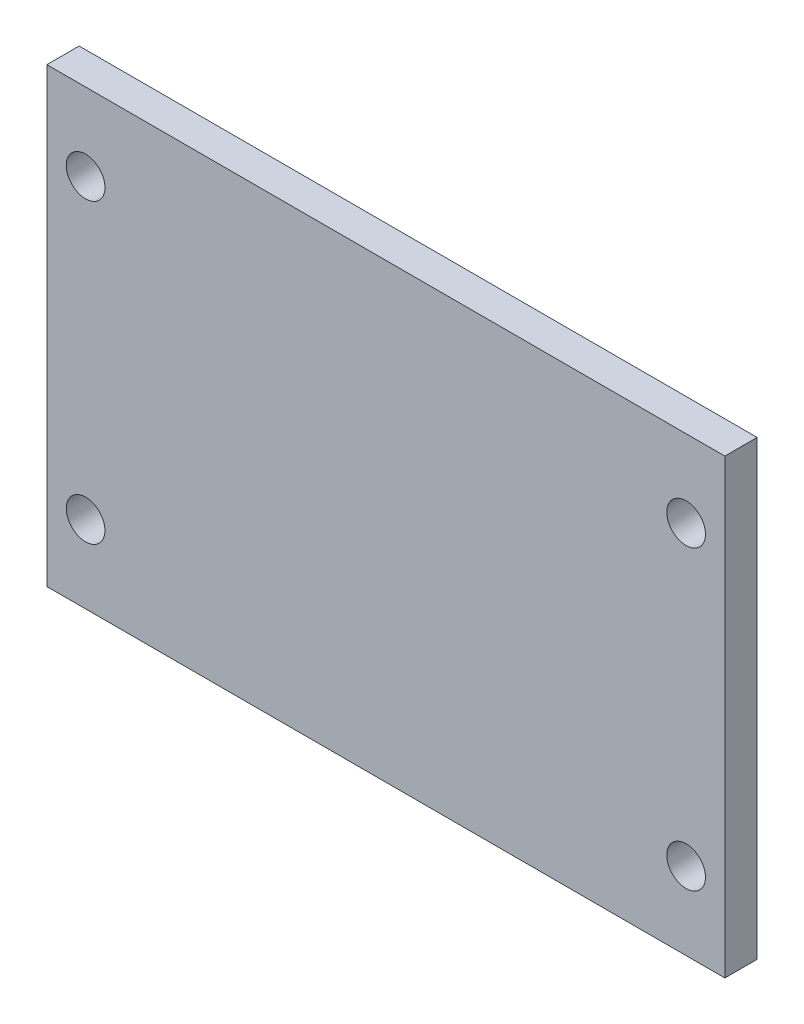
ISO-10303-21;
HEADER;
FILE_DESCRIPTION(('STEP AP214'),'2;1');
FILE_NAME('part.step','',(''),(''),'','','');
FILE_SCHEMA(('AUTOMOTIVE_DESIGN { 1 0 10303 214 1 1 1 1 }'));
ENDSEC;
DATA;
#1=APPLICATION_CONTEXT('core data for automotive mechanical design processes');
#2=APPLICATION_PROTOCOL_DEFINITION('international standard','automotive_design',2000,#1);
#3=PRODUCT_CONTEXT('',#1,'mechanical');
#4=PRODUCT('Part','Part','',(#3));
#5=PRODUCT_RELATED_PRODUCT_CATEGORY('part','',(#4));
#6=PRODUCT_DEFINITION_FORMATION('','',#4);
#7=PRODUCT_DEFINITION_CONTEXT('part definition',#1,'design');
#8=PRODUCT_DEFINITION('design','',#6,#7);
#9=PRODUCT_DEFINITION_SHAPE('','',#8);
#10=(LENGTH_UNIT() NAMED_UNIT(*) SI_UNIT(.MILLI.,.METRE.));
#11=(NAMED_UNIT(*) PLANE_ANGLE_UNIT() SI_UNIT($,.RADIAN.));
#12=(NAMED_UNIT(*) SI_UNIT($,.STERADIAN.) SOLID_ANGLE_UNIT());
#13=UNCERTAINTY_MEASURE_WITH_UNIT(LENGTH_MEASURE(1.E-05),#10,'distance_accuracy_value','');
#14=(GEOMETRIC_REPRESENTATION_CONTEXT(3) GLOBAL_UNCERTAINTY_ASSIGNED_CONTEXT((#13)) GLOBAL_UNIT_ASSIGNED_CONTEXT((#10,
#11,#12)) REPRESENTATION_CONTEXT('',''));
#15=CARTESIAN_POINT('',(0.,0.,0.));
#16=DIRECTION('',(0.,0.,1.));
#17=DIRECTION('',(1.,0.,0.));
#18=AXIS2_PLACEMENT_3D('',#15,#16,#17);
#19=CARTESIAN_POINT('',(-52.5,35.,2.5));
#20=DIRECTION('',(1.,0.,0.));
#21=DIRECTION('',(0.,1.,0.));
#22=AXIS2_PLACEMENT_3D('',#19,#20,#21);
#23=PLANE('',#22);
#24=DIRECTION('',(0.,-1.,0.));
#25=VECTOR('',#24,1.);
#26=CARTESIAN_POINT('',(-52.5,35.,-2.5));
#27=LINE('',#26,#25);
#28=CARTESIAN_POINT('',(-52.5,35.,-2.5));
#29=VERTEX_POINT('',#28);
#30=CARTESIAN_POINT('',(-52.5,-35.,-2.5));
#31=VERTEX_POINT('',#30);
#32=EDGE_CURVE('E95',#29,#31,#27,.T.);
#33=ORIENTED_EDGE('',*,*,#32,.T.);
#34=DIRECTION('',(0.,0.,-1.));
#35=VECTOR('',#34,1.);
#36=CARTESIAN_POINT('',(-52.5,-35.,2.5));
#37=LINE('',#36,#35);
#38=CARTESIAN_POINT('',(-52.5,-35.,2.5));
#39=VERTEX_POINT('',#38);
#40=EDGE_CURVE('E11',#39,#31,#37,.T.);
#41=ORIENTED_EDGE('',*,*,#40,.F.);
#42=DIRECTION('',(0.,-1.,0.));
#43=VECTOR('',#42,1.);
#44=CARTESIAN_POINT('',(-52.5,35.,2.5));
#45=LINE('',#44,#43);
#46=CARTESIAN_POINT('',(-52.5,35.,2.5));
#47=VERTEX_POINT('',#46);
#48=EDGE_CURVE('E83',#47,#39,#45,.T.);
#49=ORIENTED_EDGE('',*,*,#48,.F.);
#50=DIRECTION('',(0.,0.,-1.));
#51=VECTOR('',#50,1.);
#52=CARTESIAN_POINT('',(-52.5,35.,2.5));
#53=LINE('',#52,#51);
#54=EDGE_CURVE('E91',#47,#29,#53,.T.);
#55=ORIENTED_EDGE('',*,*,#54,.T.);
#56=EDGE_LOOP('',(#33,#41,#49,#55));
#57=FACE_BOUND('',#56,.T.);
#58=ADVANCED_FACE('F32',(#57),#23,.F.);
#59=CARTESIAN_POINT('',(-52.5,-35.,2.5));
#60=DIRECTION('',(0.,1.,0.));
#61=DIRECTION('',(0.,0.,1.));
#62=AXIS2_PLACEMENT_3D('',#59,#60,#61);
#63=PLANE('',#62);
#64=DIRECTION('',(1.,0.,0.));
#65=VECTOR('',#64,1.);
#66=CARTESIAN_POINT('',(-52.5,-35.,-2.5));
#67=LINE('',#66,#65);
#68=CARTESIAN_POINT('',(52.5,-35.,-2.5));
#69=VERTEX_POINT('',#68);
#70=EDGE_CURVE('E87',#31,#69,#67,.T.);
#71=ORIENTED_EDGE('',*,*,#70,.T.);
#72=DIRECTION('',(0.,0.,-1.));
#73=VECTOR('',#72,1.);
#74=CARTESIAN_POINT('',(52.5,-35.,2.5));
#75=LINE('',#74,#73);
#76=CARTESIAN_POINT('',(52.5,-35.,2.5));
#77=VERTEX_POINT('',#76);
#78=EDGE_CURVE('E40',#77,#69,#75,.T.);
#79=ORIENTED_EDGE('',*,*,#78,.F.);
#80=DIRECTION('',(1.,0.,0.));
#81=VECTOR('',#80,1.);
#82=CARTESIAN_POINT('',(-52.5,-35.,2.5));
#83=LINE('',#82,#81);
#84=EDGE_CURVE('E78',#39,#77,#83,.T.);
#85=ORIENTED_EDGE('',*,*,#84,.F.);
#86=ORIENTED_EDGE('',*,*,#40,.T.);
#87=EDGE_LOOP('',(#71,#79,#85,#86));
#88=FACE_BOUND('',#87,.T.);
#89=ADVANCED_FACE('F86',(#88),#63,.F.);
#90=CARTESIAN_POINT('',(52.5,35.,2.5));
#91=DIRECTION('',(-1.,0.,0.));
#92=DIRECTION('',(0.,-1.,0.));
#93=AXIS2_PLACEMENT_3D('',#90,#91,#92);
#94=PLANE('',#93);
#95=DIRECTION('',(0.,1.,0.));
#96=VECTOR('',#95,1.);
#97=CARTESIAN_POINT('',(52.5,35.,-2.5));
#98=LINE('',#97,#96);
#99=CARTESIAN_POINT('',(52.5,35.,-2.5));
#100=VERTEX_POINT('',#99);
#101=EDGE_CURVE('E65',#69,#100,#98,.T.);
#102=ORIENTED_EDGE('',*,*,#101,.T.);
#103=DIRECTION('',(0.,0.,-1.));
#104=VECTOR('',#103,1.);
#105=CARTESIAN_POINT('',(52.5,35.,2.5));
#106=LINE('',#105,#104);
#107=CARTESIAN_POINT('',(52.5,35.,2.5));
#108=VERTEX_POINT('',#107);
#109=EDGE_CURVE('E88',#108,#100,#106,.T.);
#110=ORIENTED_EDGE('',*,*,#109,.F.);
#111=DIRECTION('',(0.,1.,0.));
#112=VECTOR('',#111,1.);
#113=CARTESIAN_POINT('',(52.5,35.,2.5));
#114=LINE('',#113,#112);
#115=EDGE_CURVE('E81',#77,#108,#114,.T.);
#116=ORIENTED_EDGE('',*,*,#115,.F.);
#117=ORIENTED_EDGE('',*,*,#78,.T.);
#118=EDGE_LOOP('',(#102,#110,#116,#117));
#119=FACE_BOUND('',#118,.T.);
#120=ADVANCED_FACE('F89',(#119),#94,.F.);
#121=CARTESIAN_POINT('',(-52.5,35.,2.5));
#122=DIRECTION('',(0.,-1.,0.));
#123=DIRECTION('',(0.,0.,-1.));
#124=AXIS2_PLACEMENT_3D('',#121,#122,#123);
#125=PLANE('',#124);
#126=DIRECTION('',(-1.,0.,0.));
#127=VECTOR('',#126,1.);
#128=CARTESIAN_POINT('',(-52.5,35.,-2.5));
#129=LINE('',#128,#127);
#130=EDGE_CURVE('E71',#100,#29,#129,.T.);
#131=ORIENTED_EDGE('',*,*,#130,.T.);
#132=ORIENTED_EDGE('',*,*,#54,.F.);
#133=DIRECTION('',(-1.,0.,0.));
#134=VECTOR('',#133,1.);
#135=CARTESIAN_POINT('',(-52.5,35.,2.5));
#136=LINE('',#135,#134);
#137=EDGE_CURVE('E48',#108,#47,#136,.T.);
#138=ORIENTED_EDGE('',*,*,#137,.F.);
#139=ORIENTED_EDGE('',*,*,#109,.T.);
#140=EDGE_LOOP('',(#131,#132,#138,#139));
#141=FACE_BOUND('',#140,.T.);
#142=ADVANCED_FACE('F103',(#141),#125,.F.);
#143=CARTESIAN_POINT('',(0.,0.,2.5));
#144=DIRECTION('',(0.,0.,1.));
#145=DIRECTION('',(1.,0.,0.));
#146=AXIS2_PLACEMENT_3D('',#143,#144,#145);
#147=PLANE('',#146);
#148=CARTESIAN_POINT('',(-46.5,23.,2.5));
#149=DIRECTION('',(0.,0.,1.));
#150=DIRECTION('',(1.,0.,0.));
#151=AXIS2_PLACEMENT_3D('',#148,#149,#150);
#152=CIRCLE('',#151,2.99999999999999);
#153=CARTESIAN_POINT('',(-43.5,23.,2.5));
#154=VERTEX_POINT('',#153);
#155=EDGE_CURVE('E129',#154,#154,#152,.T.);
#156=ORIENTED_EDGE('',*,*,#155,.F.);
#157=EDGE_LOOP('',(#156));
#158=FACE_BOUND('',#157,.T.);
#159=CARTESIAN_POINT('',(-46.5,-23.,2.5));
#160=DIRECTION('',(0.,0.,1.));
#161=DIRECTION('',(1.,0.,0.));
#162=AXIS2_PLACEMENT_3D('',#159,#160,#161);
#163=CIRCLE('',#162,2.99999999999999);
#164=CARTESIAN_POINT('',(-43.5,-23.,2.5));
#165=VERTEX_POINT('',#164);
#166=EDGE_CURVE('E123',#165,#165,#163,.T.);
#167=ORIENTED_EDGE('',*,*,#166,.F.);
#168=EDGE_LOOP('',(#167));
#169=FACE_BOUND('',#168,.T.);
#170=CARTESIAN_POINT('',(46.5,-23.,2.5));
#171=DIRECTION('',(0.,0.,1.));
#172=DIRECTION('',(1.,0.,0.));
#173=AXIS2_PLACEMENT_3D('',#170,#171,#172);
#174=CIRCLE('',#173,2.99999999999999);
#175=CARTESIAN_POINT('',(49.5,-23.,2.5));
#176=VERTEX_POINT('',#175);
#177=EDGE_CURVE('E117',#176,#176,#174,.T.);
#178=ORIENTED_EDGE('',*,*,#177,.F.);
#179=EDGE_LOOP('',(#178));
#180=FACE_BOUND('',#179,.T.);
#181=CARTESIAN_POINT('',(46.5,23.,2.5));
#182=DIRECTION('',(0.,0.,1.));
#183=DIRECTION('',(1.,0.,0.));
#184=AXIS2_PLACEMENT_3D('',#181,#182,#183);
#185=CIRCLE('',#184,2.99999999999999);
#186=CARTESIAN_POINT('',(49.5,23.,2.5));
#187=VERTEX_POINT('',#186);
#188=EDGE_CURVE('E111',#187,#187,#185,.T.);
#189=ORIENTED_EDGE('',*,*,#188,.F.);
#190=EDGE_LOOP('',(#189));
#191=FACE_BOUND('',#190,.T.);
#192=ORIENTED_EDGE('',*,*,#48,.T.);
#193=ORIENTED_EDGE('',*,*,#84,.T.);
#194=ORIENTED_EDGE('',*,*,#115,.T.);
#195=ORIENTED_EDGE('',*,*,#137,.T.);
#196=EDGE_LOOP('',(#192,#193,#194,#195));
#197=FACE_BOUND('',#196,.T.);
#198=ADVANCED_FACE('F79',(#158,#169,#180,#191,#197),#147,.T.);
#199=CARTESIAN_POINT('',(0.,0.,-2.5));
#200=DIRECTION('',(0.,0.,1.));
#201=DIRECTION('',(1.,0.,0.));
#202=AXIS2_PLACEMENT_3D('',#199,#200,#201);
#203=PLANE('',#202);
#204=CARTESIAN_POINT('',(-46.5,23.,-2.5));
#205=DIRECTION('',(0.,0.,1.));
#206=DIRECTION('',(1.,0.,0.));
#207=AXIS2_PLACEMENT_3D('',#204,#205,#206);
#208=CIRCLE('',#207,2.99999999999999);
#209=CARTESIAN_POINT('',(-43.5,23.,-2.5));
#210=VERTEX_POINT('',#209);
#211=EDGE_CURVE('E126',#210,#210,#208,.T.);
#212=ORIENTED_EDGE('',*,*,#211,.T.);
#213=EDGE_LOOP('',(#212));
#214=FACE_BOUND('',#213,.T.);
#215=CARTESIAN_POINT('',(-46.5,-23.,-2.5));
#216=DIRECTION('',(0.,0.,1.));
#217=DIRECTION('',(1.,0.,0.));
#218=AXIS2_PLACEMENT_3D('',#215,#216,#217);
#219=CIRCLE('',#218,2.99999999999999);
#220=CARTESIAN_POINT('',(-43.5,-23.,-2.5));
#221=VERTEX_POINT('',#220);
#222=EDGE_CURVE('E120',#221,#221,#219,.T.);
#223=ORIENTED_EDGE('',*,*,#222,.T.);
#224=EDGE_LOOP('',(#223));
#225=FACE_BOUND('',#224,.T.);
#226=CARTESIAN_POINT('',(46.5,-23.,-2.5));
#227=DIRECTION('',(0.,0.,1.));
#228=DIRECTION('',(1.,0.,0.));
#229=AXIS2_PLACEMENT_3D('',#226,#227,#228);
#230=CIRCLE('',#229,2.99999999999999);
#231=CARTESIAN_POINT('',(49.5,-23.,-2.5));
#232=VERTEX_POINT('',#231);
#233=EDGE_CURVE('E114',#232,#232,#230,.T.);
#234=ORIENTED_EDGE('',*,*,#233,.T.);
#235=EDGE_LOOP('',(#234));
#236=FACE_BOUND('',#235,.T.);
#237=CARTESIAN_POINT('',(46.5,23.,-2.5));
#238=DIRECTION('',(0.,0.,1.));
#239=DIRECTION('',(1.,0.,0.));
#240=AXIS2_PLACEMENT_3D('',#237,#238,#239);
#241=CIRCLE('',#240,2.99999999999999);
#242=CARTESIAN_POINT('',(49.5,23.,-2.5));
#243=VERTEX_POINT('',#242);
#244=EDGE_CURVE('E98',#243,#243,#241,.T.);
#245=ORIENTED_EDGE('',*,*,#244,.T.);
#246=EDGE_LOOP('',(#245));
#247=FACE_BOUND('',#246,.T.);
#248=ORIENTED_EDGE('',*,*,#32,.F.);
#249=ORIENTED_EDGE('',*,*,#130,.F.);
#250=ORIENTED_EDGE('',*,*,#101,.F.);
#251=ORIENTED_EDGE('',*,*,#70,.F.);
#252=EDGE_LOOP('',(#248,#249,#250,#251));
#253=FACE_BOUND('',#252,.T.);
#254=ADVANCED_FACE('F106',(#214,#225,#236,#247,#253),#203,.F.);
#255=CARTESIAN_POINT('',(46.5,23.,2.5));
#256=DIRECTION('',(0.,0.,1.));
#257=DIRECTION('',(1.,0.,0.));
#258=AXIS2_PLACEMENT_3D('',#255,#256,#257);
#259=CYLINDRICAL_SURFACE('',#258,2.99999999999999);
#260=ORIENTED_EDGE('',*,*,#244,.F.);
#261=EDGE_LOOP('',(#260));
#262=FACE_BOUND('',#261,.T.);
#263=ORIENTED_EDGE('',*,*,#188,.T.);
#264=EDGE_LOOP('',(#263));
#265=FACE_BOUND('',#264,.T.);
#266=ADVANCED_FACE('F144',(#262,#265),#259,.F.);
#267=CARTESIAN_POINT('',(46.5,-23.,2.5));
#268=DIRECTION('',(0.,0.,1.));
#269=DIRECTION('',(1.,0.,0.));
#270=AXIS2_PLACEMENT_3D('',#267,#268,#269);
#271=CYLINDRICAL_SURFACE('',#270,2.99999999999999);
#272=ORIENTED_EDGE('',*,*,#233,.F.);
#273=EDGE_LOOP('',(#272));
#274=FACE_BOUND('',#273,.T.);
#275=ORIENTED_EDGE('',*,*,#177,.T.);
#276=EDGE_LOOP('',(#275));
#277=FACE_BOUND('',#276,.T.);
#278=ADVANCED_FACE('F146',(#274,#277),#271,.F.);
#279=CARTESIAN_POINT('',(-46.5,-23.,2.5));
#280=DIRECTION('',(0.,0.,1.));
#281=DIRECTION('',(1.,0.,0.));
#282=AXIS2_PLACEMENT_3D('',#279,#280,#281);
#283=CYLINDRICAL_SURFACE('',#282,2.99999999999999);
#284=ORIENTED_EDGE('',*,*,#222,.F.);
#285=EDGE_LOOP('',(#284));
#286=FACE_BOUND('',#285,.T.);
#287=ORIENTED_EDGE('',*,*,#166,.T.);
#288=EDGE_LOOP('',(#287));
#289=FACE_BOUND('',#288,.T.);
#290=ADVANCED_FACE('F153',(#286,#289),#283,.F.);
#291=CARTESIAN_POINT('',(-46.5,23.,2.5));
#292=DIRECTION('',(0.,0.,1.));
#293=DIRECTION('',(1.,0.,0.));
#294=AXIS2_PLACEMENT_3D('',#291,#292,#293);
#295=CYLINDRICAL_SURFACE('',#294,2.99999999999999);
#296=ORIENTED_EDGE('',*,*,#211,.F.);
#297=EDGE_LOOP('',(#296));
#298=FACE_BOUND('',#297,.T.);
#299=ORIENTED_EDGE('',*,*,#155,.T.);
#300=EDGE_LOOP('',(#299));
#301=FACE_BOUND('',#300,.T.);
#302=ADVANCED_FACE('F133',(#298,#301),#295,.F.);
#303=CLOSED_SHELL('',(#58,#89,#120,#142,#198,#254,#266,#278,#290,#302));
#304=MANIFOLD_SOLID_BREP('B2',#303);
#305=ADVANCED_BREP_SHAPE_REPRESENTATION('',(#18,#304),#14);
#306=SHAPE_DEFINITION_REPRESENTATION(#9,#305);
ENDSEC;
END-ISO-10303-21;
